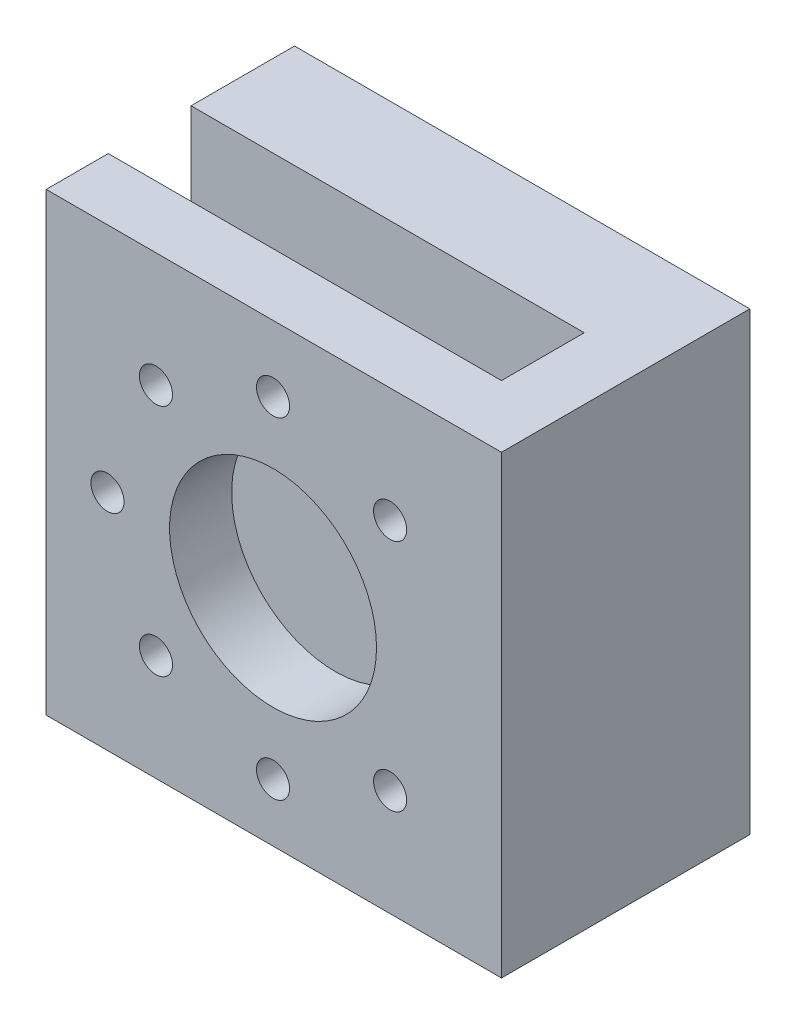
ISO-10303-21;
HEADER;
FILE_DESCRIPTION(('STEP AP214'),'2;1');
FILE_NAME('part.step','',(''),(''),'','','');
FILE_SCHEMA(('AUTOMOTIVE_DESIGN { 1 0 10303 214 1 1 1 1 }'));
ENDSEC;
DATA;
#1=APPLICATION_CONTEXT('core data for automotive mechanical design processes');
#2=APPLICATION_PROTOCOL_DEFINITION('international standard','automotive_design',2000,#1);
#3=PRODUCT_CONTEXT('',#1,'mechanical');
#4=PRODUCT('Part','Part','',(#3));
#5=PRODUCT_RELATED_PRODUCT_CATEGORY('part','',(#4));
#6=PRODUCT_DEFINITION_FORMATION('','',#4);
#7=PRODUCT_DEFINITION_CONTEXT('part definition',#1,'design');
#8=PRODUCT_DEFINITION('design','',#6,#7);
#9=PRODUCT_DEFINITION_SHAPE('','',#8);
#10=(LENGTH_UNIT() NAMED_UNIT(*) SI_UNIT(.MILLI.,.METRE.));
#11=(NAMED_UNIT(*) PLANE_ANGLE_UNIT() SI_UNIT($,.RADIAN.));
#12=(NAMED_UNIT(*) SI_UNIT($,.STERADIAN.) SOLID_ANGLE_UNIT());
#13=UNCERTAINTY_MEASURE_WITH_UNIT(LENGTH_MEASURE(1.E-05),#10,'distance_accuracy_value','');
#14=(GEOMETRIC_REPRESENTATION_CONTEXT(3) GLOBAL_UNCERTAINTY_ASSIGNED_CONTEXT((#13)) GLOBAL_UNIT_ASSIGNED_CONTEXT((#10,
#11,#12)) REPRESENTATION_CONTEXT('',''));
#15=CARTESIAN_POINT('',(0.,0.,0.));
#16=DIRECTION('',(0.,0.,1.));
#17=DIRECTION('',(1.,0.,0.));
#18=AXIS2_PLACEMENT_3D('',#15,#16,#17);
#19=CARTESIAN_POINT('',(30.189928032533,-41.0242307047734,12.5));
#20=DIRECTION('',(-1.,0.,0.));
#21=DIRECTION('',(0.,-1.,0.));
#22=AXIS2_PLACEMENT_3D('',#19,#20,#21);
#23=CYLINDRICAL_SURFACE('',#22,4.);
#24=CARTESIAN_POINT('',(-1.31007196746698,-41.0242307047734,12.5));
#25=DIRECTION('',(1.,0.,0.));
#26=DIRECTION('',(0.,1.,0.));
#27=AXIS2_PLACEMENT_3D('',#24,#25,#26);
#28=CIRCLE('',#27,4.);
#29=CARTESIAN_POINT('',(-1.31007196746697,-37.0242307047734,12.5));
#30=VERTEX_POINT('',#29);
#31=EDGE_CURVE('E215',#30,#30,#28,.T.);
#32=ORIENTED_EDGE('',*,*,#31,.T.);
#33=EDGE_LOOP('',(#32));
#34=FACE_BOUND('',#33,.T.);
#35=CARTESIAN_POINT('',(-34.810071967467,-41.0242307047734,12.5));
#36=DIRECTION('',(-1.,0.,0.));
#37=DIRECTION('',(0.,-1.,0.));
#38=AXIS2_PLACEMENT_3D('',#35,#36,#37);
#39=CIRCLE('',#38,4.);
#40=CARTESIAN_POINT('',(-34.810071967467,-45.0242307047734,12.5));
#41=VERTEX_POINT('',#40);
#42=EDGE_CURVE('E44',#41,#41,#39,.F.);
#43=ORIENTED_EDGE('',*,*,#42,.F.);
#44=EDGE_LOOP('',(#43));
#45=FACE_BOUND('',#44,.T.);
#46=ADVANCED_FACE('F40',(#34,#45),#23,.F.);
#47=CARTESIAN_POINT('',(0.189928032533093,0.921720798084353,25.));
#48=DIRECTION('',(0.,0.,-1.));
#49=DIRECTION('',(-1.,0.,0.));
#50=AXIS2_PLACEMENT_3D('',#47,#48,#49);
#51=CYLINDRICAL_SURFACE('',#50,19.);
#52=CARTESIAN_POINT('',(0.189928032533093,0.921720798084353,0.));
#53=DIRECTION('',(0.,0.,1.));
#54=DIRECTION('',(1.,0.,0.));
#55=AXIS2_PLACEMENT_3D('',#52,#53,#54);
#56=CIRCLE('',#55,19.);
#57=CARTESIAN_POINT('',(1.6899280325331,-18.0189761267915,0.));
#58=VERTEX_POINT('',#57);
#59=CARTESIAN_POINT('',(6.82022844235498,18.7273130790369,0.));
#60=VERTEX_POINT('',#59);
#61=EDGE_CURVE('E166',#58,#60,#56,.T.);
#62=ORIENTED_EDGE('',*,*,#61,.F.);
#63=DIRECTION('',(0.,0.,-1.));
#64=VECTOR('',#63,1.);
#65=CARTESIAN_POINT('',(1.6899280325331,-18.0189761267915,25.));
#66=LINE('',#65,#64);
#67=CARTESIAN_POINT('',(1.6899280325331,-18.0189761267915,25.));
#68=VERTEX_POINT('',#67);
#69=EDGE_CURVE('E11',#68,#58,#66,.T.);
#70=ORIENTED_EDGE('',*,*,#69,.F.);
#71=CARTESIAN_POINT('',(0.189928032533093,0.921720798084353,25.));
#72=DIRECTION('',(0.,0.,1.));
#73=DIRECTION('',(1.,0.,0.));
#74=AXIS2_PLACEMENT_3D('',#71,#72,#73);
#75=CIRCLE('',#74,19.);
#76=CARTESIAN_POINT('',(6.82022844235498,18.7273130790369,25.));
#77=VERTEX_POINT('',#76);
#78=EDGE_CURVE('E197',#68,#77,#75,.T.);
#79=ORIENTED_EDGE('',*,*,#78,.T.);
#80=DIRECTION('',(0.,0.,-1.));
#81=VECTOR('',#80,1.);
#82=CARTESIAN_POINT('',(6.82022844235498,18.7273130790369,25.));
#83=LINE('',#82,#81);
#84=EDGE_CURVE('E66',#77,#60,#83,.T.);
#85=ORIENTED_EDGE('',*,*,#84,.T.);
#86=EDGE_LOOP('',(#62,#70,#79,#85));
#87=FACE_BOUND('',#86,.T.);
#88=ADVANCED_FACE('F42',(#87),#51,.F.);
#89=CARTESIAN_POINT('',(1.68992803253316,0.,25.));
#90=DIRECTION('',(1.,0.,0.));
#91=DIRECTION('',(0.,1.,0.));
#92=AXIS2_PLACEMENT_3D('',#89,#90,#91);
#93=PLANE('',#92);
#94=CARTESIAN_POINT('',(1.68992803253302,-41.0242307047734,12.5));
#95=DIRECTION('',(1.,0.,0.));
#96=DIRECTION('',(0.,1.,0.));
#97=AXIS2_PLACEMENT_3D('',#94,#95,#96);
#98=CIRCLE('',#97,4.);
#99=CARTESIAN_POINT('',(1.68992803253303,-37.0242307047734,12.5));
#100=VERTEX_POINT('',#99);
#101=EDGE_CURVE('E169',#100,#100,#98,.T.);
#102=ORIENTED_EDGE('',*,*,#101,.T.);
#103=EDGE_LOOP('',(#102));
#104=FACE_BOUND('',#103,.T.);
#105=DIRECTION('',(0.,-1.,0.));
#106=VECTOR('',#105,1.);
#107=CARTESIAN_POINT('',(1.68992803253316,0.,0.));
#108=LINE('',#107,#106);
#109=CARTESIAN_POINT('',(1.68992803253297,-54.0242307047734,0.));
#110=VERTEX_POINT('',#109);
#111=EDGE_CURVE('E168',#58,#110,#108,.T.);
#112=ORIENTED_EDGE('',*,*,#111,.T.);
#113=DIRECTION('',(0.,0.,-1.));
#114=VECTOR('',#113,1.);
#115=CARTESIAN_POINT('',(1.68992803253297,-54.0242307047734,25.));
#116=LINE('',#115,#114);
#117=CARTESIAN_POINT('',(1.68992803253297,-54.0242307047734,25.));
#118=VERTEX_POINT('',#117);
#119=EDGE_CURVE('E49',#118,#110,#116,.T.);
#120=ORIENTED_EDGE('',*,*,#119,.F.);
#121=DIRECTION('',(0.,-1.,0.));
#122=VECTOR('',#121,1.);
#123=CARTESIAN_POINT('',(1.68992803253316,0.,25.));
#124=LINE('',#123,#122);
#125=EDGE_CURVE('E233',#68,#118,#124,.T.);
#126=ORIENTED_EDGE('',*,*,#125,.F.);
#127=ORIENTED_EDGE('',*,*,#69,.T.);
#128=EDGE_LOOP('',(#112,#120,#126,#127));
#129=FACE_BOUND('',#128,.T.);
#130=ADVANCED_FACE('F256',(#104,#129),#93,.F.);
#131=CARTESIAN_POINT('',(0.,-54.0242307047734,25.));
#132=DIRECTION('',(0.,1.,0.));
#133=DIRECTION('',(0.,0.,1.));
#134=AXIS2_PLACEMENT_3D('',#131,#132,#133);
#135=PLANE('',#134);
#136=DIRECTION('',(1.,0.,0.));
#137=VECTOR('',#136,1.);
#138=CARTESIAN_POINT('',(0.,-54.0242307047734,0.));
#139=LINE('',#138,#137);
#140=CARTESIAN_POINT('',(55.189928032533,-54.0242307047734,0.));
#141=VERTEX_POINT('',#140);
#142=EDGE_CURVE('E171',#110,#141,#139,.T.);
#143=ORIENTED_EDGE('',*,*,#142,.T.);
#144=DIRECTION('',(0.,0.,-1.));
#145=VECTOR('',#144,1.);
#146=CARTESIAN_POINT('',(55.189928032533,-54.0242307047734,25.));
#147=LINE('',#146,#145);
#148=CARTESIAN_POINT('',(55.189928032533,-54.0242307047734,60.));
#149=VERTEX_POINT('',#148);
#150=EDGE_CURVE('E212',#149,#141,#147,.T.);
#151=ORIENTED_EDGE('',*,*,#150,.F.);
#152=DIRECTION('',(1.,0.,0.));
#153=VECTOR('',#152,1.);
#154=CARTESIAN_POINT('',(55.189928032533,-54.0242307047734,60.));
#155=LINE('',#154,#153);
#156=CARTESIAN_POINT('',(-54.810071967467,-54.0242307047734,60.));
#157=VERTEX_POINT('',#156);
#158=EDGE_CURVE('E303',#157,#149,#155,.T.);
#159=ORIENTED_EDGE('',*,*,#158,.F.);
#160=DIRECTION('',(0.,0.,-1.));
#161=VECTOR('',#160,1.);
#162=CARTESIAN_POINT('',(-54.810071967467,-54.0242307047734,60.));
#163=LINE('',#162,#161);
#164=CARTESIAN_POINT('',(-54.810071967467,-54.0242307047734,45.));
#165=VERTEX_POINT('',#164);
#166=EDGE_CURVE('E313',#157,#165,#163,.T.);
#167=ORIENTED_EDGE('',*,*,#166,.T.);
#168=DIRECTION('',(1.,0.,0.));
#169=VECTOR('',#168,1.);
#170=CARTESIAN_POINT('',(55.189928032533,-54.0242307047734,45.));
#171=LINE('',#170,#169);
#172=CARTESIAN_POINT('',(40.189928032533,-54.0242307047734,45.));
#173=VERTEX_POINT('',#172);
#174=EDGE_CURVE('E328',#165,#173,#171,.T.);
#175=ORIENTED_EDGE('',*,*,#174,.T.);
#176=DIRECTION('',(0.,0.,-1.));
#177=VECTOR('',#176,1.);
#178=CARTESIAN_POINT('',(40.189928032533,-54.0242307047734,45.));
#179=LINE('',#178,#177);
#180=CARTESIAN_POINT('',(40.189928032533,-54.0242307047734,25.));
#181=VERTEX_POINT('',#180);
#182=EDGE_CURVE('E336',#173,#181,#179,.T.);
#183=ORIENTED_EDGE('',*,*,#182,.T.);
#184=DIRECTION('',(1.,0.,0.));
#185=VECTOR('',#184,1.);
#186=CARTESIAN_POINT('',(0.,-54.0242307047734,25.));
#187=LINE('',#186,#185);
#188=EDGE_CURVE('E235',#118,#181,#187,.T.);
#189=ORIENTED_EDGE('',*,*,#188,.F.);
#190=ORIENTED_EDGE('',*,*,#119,.T.);
#191=EDGE_LOOP('',(#143,#151,#159,#167,#175,#183,#189,#190));
#192=FACE_BOUND('',#191,.T.);
#193=ADVANCED_FACE('F261',(#192),#135,.F.);
#194=CARTESIAN_POINT('',(55.189928032533,0.,25.));
#195=DIRECTION('',(1.,0.,0.));
#196=DIRECTION('',(0.,1.,0.));
#197=AXIS2_PLACEMENT_3D('',#194,#195,#196);
#198=PLANE('',#197);
#199=DIRECTION('',(0.,-1.,0.));
#200=VECTOR('',#199,1.);
#201=CARTESIAN_POINT('',(55.189928032533,0.,0.));
#202=LINE('',#201,#200);
#203=CARTESIAN_POINT('',(55.189928032533,55.9757692952266,0.));
#204=VERTEX_POINT('',#203);
#205=EDGE_CURVE('E174',#204,#141,#202,.T.);
#206=ORIENTED_EDGE('',*,*,#205,.F.);
#207=DIRECTION('',(0.,0.,-1.));
#208=VECTOR('',#207,1.);
#209=CARTESIAN_POINT('',(55.189928032533,55.9757692952266,25.));
#210=LINE('',#209,#208);
#211=CARTESIAN_POINT('',(55.189928032533,55.9757692952266,60.));
#212=VERTEX_POINT('',#211);
#213=EDGE_CURVE('E210',#212,#204,#210,.T.);
#214=ORIENTED_EDGE('',*,*,#213,.F.);
#215=DIRECTION('',(0.,1.,0.));
#216=VECTOR('',#215,1.);
#217=CARTESIAN_POINT('',(55.189928032533,55.9757692952266,60.));
#218=LINE('',#217,#216);
#219=EDGE_CURVE('E298',#149,#212,#218,.T.);
#220=ORIENTED_EDGE('',*,*,#219,.F.);
#221=ORIENTED_EDGE('',*,*,#150,.T.);
#222=EDGE_LOOP('',(#206,#214,#220,#221));
#223=FACE_BOUND('',#222,.T.);
#224=ADVANCED_FACE('F292',(#223),#198,.T.);
#225=CARTESIAN_POINT('',(0.,55.9757692952266,25.));
#226=DIRECTION('',(0.,1.,0.));
#227=DIRECTION('',(0.,0.,1.));
#228=AXIS2_PLACEMENT_3D('',#225,#226,#227);
#229=PLANE('',#228);
#230=DIRECTION('',(1.,0.,0.));
#231=VECTOR('',#230,1.);
#232=CARTESIAN_POINT('',(0.,55.9757692952266,0.));
#233=LINE('',#232,#231);
#234=CARTESIAN_POINT('',(-54.810071967467,55.9757692952266,0.));
#235=VERTEX_POINT('',#234);
#236=EDGE_CURVE('E177',#235,#204,#233,.T.);
#237=ORIENTED_EDGE('',*,*,#236,.F.);
#238=DIRECTION('',(0.,0.,-1.));
#239=VECTOR('',#238,1.);
#240=CARTESIAN_POINT('',(-54.810071967467,55.9757692952266,25.));
#241=LINE('',#240,#239);
#242=CARTESIAN_POINT('',(-54.810071967467,55.9757692952266,25.));
#243=VERTEX_POINT('',#242);
#244=EDGE_CURVE('E208',#243,#235,#241,.T.);
#245=ORIENTED_EDGE('',*,*,#244,.F.);
#246=DIRECTION('',(1.,0.,0.));
#247=VECTOR('',#246,1.);
#248=CARTESIAN_POINT('',(0.,55.9757692952266,25.));
#249=LINE('',#248,#247);
#250=CARTESIAN_POINT('',(40.189928032533,55.9757692952266,25.));
#251=VERTEX_POINT('',#250);
#252=EDGE_CURVE('E237',#243,#251,#249,.T.);
#253=ORIENTED_EDGE('',*,*,#252,.T.);
#254=DIRECTION('',(0.,0.,-1.));
#255=VECTOR('',#254,1.);
#256=CARTESIAN_POINT('',(40.189928032533,55.9757692952266,45.));
#257=LINE('',#256,#255);
#258=CARTESIAN_POINT('',(40.189928032533,55.9757692952266,45.));
#259=VERTEX_POINT('',#258);
#260=EDGE_CURVE('E339',#259,#251,#257,.T.);
#261=ORIENTED_EDGE('',*,*,#260,.F.);
#262=DIRECTION('',(-1.,0.,0.));
#263=VECTOR('',#262,1.);
#264=CARTESIAN_POINT('',(55.189928032533,55.9757692952266,45.));
#265=LINE('',#264,#263);
#266=CARTESIAN_POINT('',(-54.810071967467,55.9757692952266,45.));
#267=VERTEX_POINT('',#266);
#268=EDGE_CURVE('E321',#259,#267,#265,.T.);
#269=ORIENTED_EDGE('',*,*,#268,.T.);
#270=DIRECTION('',(0.,0.,-1.));
#271=VECTOR('',#270,1.);
#272=CARTESIAN_POINT('',(-54.810071967467,55.9757692952266,60.));
#273=LINE('',#272,#271);
#274=CARTESIAN_POINT('',(-54.810071967467,55.9757692952266,60.));
#275=VERTEX_POINT('',#274);
#276=EDGE_CURVE('E315',#275,#267,#273,.T.);
#277=ORIENTED_EDGE('',*,*,#276,.F.);
#278=DIRECTION('',(-1.,0.,0.));
#279=VECTOR('',#278,1.);
#280=CARTESIAN_POINT('',(55.189928032533,55.9757692952266,60.));
#281=LINE('',#280,#279);
#282=EDGE_CURVE('E317',#212,#275,#281,.T.);
#283=ORIENTED_EDGE('',*,*,#282,.F.);
#284=ORIENTED_EDGE('',*,*,#213,.T.);
#285=EDGE_LOOP('',(#237,#245,#253,#261,#269,#277,#283,#284));
#286=FACE_BOUND('',#285,.T.);
#287=ADVANCED_FACE('F353',(#286),#229,.T.);
#288=CARTESIAN_POINT('',(-54.810071967467,0.,25.));
#289=DIRECTION('',(1.,0.,0.));
#290=DIRECTION('',(0.,1.,0.));
#291=AXIS2_PLACEMENT_3D('',#288,#289,#290);
#292=PLANE('',#291);
#293=CARTESIAN_POINT('',(-54.810071967467,-41.0242307047734,12.5));
#294=DIRECTION('',(-1.,0.,0.));
#295=DIRECTION('',(0.,-1.,0.));
#296=AXIS2_PLACEMENT_3D('',#293,#294,#295);
#297=CIRCLE('',#296,7.);
#298=CARTESIAN_POINT('',(-54.810071967467,-48.0242307047734,12.5));
#299=VERTEX_POINT('',#298);
#300=EDGE_CURVE('E229',#299,#299,#297,.T.);
#301=ORIENTED_EDGE('',*,*,#300,.F.);
#302=EDGE_LOOP('',(#301));
#303=FACE_BOUND('',#302,.T.);
#304=DIRECTION('',(0.,-1.,0.));
#305=VECTOR('',#304,1.);
#306=CARTESIAN_POINT('',(-54.810071967467,0.,0.));
#307=LINE('',#306,#305);
#308=CARTESIAN_POINT('',(-54.810071967467,-54.0242307047734,0.));
#309=VERTEX_POINT('',#308);
#310=EDGE_CURVE('E180',#235,#309,#307,.T.);
#311=ORIENTED_EDGE('',*,*,#310,.T.);
#312=DIRECTION('',(0.,0.,-1.));
#313=VECTOR('',#312,1.);
#314=CARTESIAN_POINT('',(-54.810071967467,-54.0242307047734,25.));
#315=LINE('',#314,#313);
#316=CARTESIAN_POINT('',(-54.810071967467,-54.0242307047734,25.));
#317=VERTEX_POINT('',#316);
#318=EDGE_CURVE('E205',#317,#309,#315,.T.);
#319=ORIENTED_EDGE('',*,*,#318,.F.);
#320=DIRECTION('',(0.,-1.,0.));
#321=VECTOR('',#320,1.);
#322=CARTESIAN_POINT('',(-54.810071967467,0.,25.));
#323=LINE('',#322,#321);
#324=EDGE_CURVE('E239',#243,#317,#323,.T.);
#325=ORIENTED_EDGE('',*,*,#324,.F.);
#326=ORIENTED_EDGE('',*,*,#244,.T.);
#327=EDGE_LOOP('',(#311,#319,#325,#326));
#328=FACE_BOUND('',#327,.T.);
#329=ADVANCED_FACE('F349',(#303,#328),#292,.F.);
#330=CARTESIAN_POINT('',(0.,-54.0242307047734,25.));
#331=DIRECTION('',(0.,1.,0.));
#332=DIRECTION('',(0.,0.,1.));
#333=AXIS2_PLACEMENT_3D('',#330,#331,#332);
#334=PLANE('',#333);
#335=DIRECTION('',(1.,0.,0.));
#336=VECTOR('',#335,1.);
#337=CARTESIAN_POINT('',(0.,-54.0242307047734,0.));
#338=LINE('',#337,#336);
#339=CARTESIAN_POINT('',(-1.31007196746703,-54.0242307047734,0.));
#340=VERTEX_POINT('',#339);
#341=EDGE_CURVE('E182',#309,#340,#338,.T.);
#342=ORIENTED_EDGE('',*,*,#341,.T.);
#343=DIRECTION('',(0.,0.,-1.));
#344=VECTOR('',#343,1.);
#345=CARTESIAN_POINT('',(-1.31007196746703,-54.0242307047734,25.));
#346=LINE('',#345,#344);
#347=CARTESIAN_POINT('',(-1.31007196746703,-54.0242307047734,25.));
#348=VERTEX_POINT('',#347);
#349=EDGE_CURVE('E203',#348,#340,#346,.T.);
#350=ORIENTED_EDGE('',*,*,#349,.F.);
#351=DIRECTION('',(1.,0.,0.));
#352=VECTOR('',#351,1.);
#353=CARTESIAN_POINT('',(0.,-54.0242307047734,25.));
#354=LINE('',#353,#352);
#355=EDGE_CURVE('E241',#317,#348,#354,.T.);
#356=ORIENTED_EDGE('',*,*,#355,.F.);
#357=ORIENTED_EDGE('',*,*,#318,.T.);
#358=EDGE_LOOP('',(#342,#350,#356,#357));
#359=FACE_BOUND('',#358,.T.);
#360=ADVANCED_FACE('F352',(#359),#334,.F.);
#361=CARTESIAN_POINT('',(-1.31007196746684,0.,25.));
#362=DIRECTION('',(1.,0.,0.));
#363=DIRECTION('',(0.,1.,0.));
#364=AXIS2_PLACEMENT_3D('',#361,#362,#363);
#365=PLANE('',#364);
#366=ORIENTED_EDGE('',*,*,#31,.F.);
#367=EDGE_LOOP('',(#366));
#368=FACE_BOUND('',#367,.T.);
#369=DIRECTION('',(0.,-1.,0.));
#370=VECTOR('',#369,1.);
#371=CARTESIAN_POINT('',(-1.31007196746684,0.,0.));
#372=LINE('',#371,#370);
#373=CARTESIAN_POINT('',(-1.3100719674669,-18.0189761267915,0.));
#374=VERTEX_POINT('',#373);
#375=EDGE_CURVE('E185',#374,#340,#372,.T.);
#376=ORIENTED_EDGE('',*,*,#375,.F.);
#377=DIRECTION('',(0.,0.,-1.));
#378=VECTOR('',#377,1.);
#379=CARTESIAN_POINT('',(-1.3100719674669,-18.0189761267915,25.));
#380=LINE('',#379,#378);
#381=CARTESIAN_POINT('',(-1.3100719674669,-18.0189761267915,25.));
#382=VERTEX_POINT('',#381);
#383=EDGE_CURVE('E201',#382,#374,#380,.T.);
#384=ORIENTED_EDGE('',*,*,#383,.F.);
#385=DIRECTION('',(0.,-1.,0.));
#386=VECTOR('',#385,1.);
#387=CARTESIAN_POINT('',(-1.31007196746684,0.,25.));
#388=LINE('',#387,#386);
#389=EDGE_CURVE('E243',#382,#348,#388,.T.);
#390=ORIENTED_EDGE('',*,*,#389,.T.);
#391=ORIENTED_EDGE('',*,*,#349,.T.);
#392=EDGE_LOOP('',(#376,#384,#390,#391));
#393=FACE_BOUND('',#392,.T.);
#394=ADVANCED_FACE('F362',(#368,#393),#365,.T.);
#395=CARTESIAN_POINT('',(0.189928032533093,0.921720798084353,25.));
#396=DIRECTION('',(0.,0.,-1.));
#397=DIRECTION('',(-1.,0.,0.));
#398=AXIS2_PLACEMENT_3D('',#395,#396,#397);
#399=CYLINDRICAL_SURFACE('',#398,19.);
#400=CARTESIAN_POINT('',(0.189928032533093,0.921720798084353,0.));
#401=DIRECTION('',(0.,0.,1.));
#402=DIRECTION('',(1.,0.,0.));
#403=AXIS2_PLACEMENT_3D('',#400,#401,#402);
#404=CIRCLE('',#403,19.);
#405=CARTESIAN_POINT('',(-6.44037237728879,18.7273130790369,0.));
#406=VERTEX_POINT('',#405);
#407=EDGE_CURVE('E188',#406,#374,#404,.T.);
#408=ORIENTED_EDGE('',*,*,#407,.F.);
#409=DIRECTION('',(0.,0.,-1.));
#410=VECTOR('',#409,1.);
#411=CARTESIAN_POINT('',(-6.44037237728879,18.7273130790369,25.));
#412=LINE('',#411,#410);
#413=CARTESIAN_POINT('',(-6.44037237728879,18.7273130790369,25.));
#414=VERTEX_POINT('',#413);
#415=EDGE_CURVE('E157',#414,#406,#412,.T.);
#416=ORIENTED_EDGE('',*,*,#415,.F.);
#417=CARTESIAN_POINT('',(0.189928032533093,0.921720798084353,25.));
#418=DIRECTION('',(0.,0.,1.));
#419=DIRECTION('',(1.,0.,0.));
#420=AXIS2_PLACEMENT_3D('',#417,#418,#419);
#421=CIRCLE('',#420,19.);
#422=EDGE_CURVE('E146',#414,#382,#421,.T.);
#423=ORIENTED_EDGE('',*,*,#422,.T.);
#424=ORIENTED_EDGE('',*,*,#383,.T.);
#425=EDGE_LOOP('',(#408,#416,#423,#424));
#426=FACE_BOUND('',#425,.T.);
#427=ADVANCED_FACE('F247',(#426),#399,.F.);
#428=CARTESIAN_POINT('',(-6.44037237728833,-1.58745285573057E-13,25.));
#429=DIRECTION('',(-1.,0.,0.));
#430=DIRECTION('',(0.,-1.,0.));
#431=AXIS2_PLACEMENT_3D('',#428,#429,#430);
#432=PLANE('',#431);
#433=DIRECTION('',(0.,1.,0.));
#434=VECTOR('',#433,1.);
#435=CARTESIAN_POINT('',(-6.44037237728833,-1.58745285573057E-13,0.));
#436=LINE('',#435,#434);
#437=CARTESIAN_POINT('',(-6.44037237728888,22.3869983796891,0.));
#438=VERTEX_POINT('',#437);
#439=EDGE_CURVE('E153',#406,#438,#436,.T.);
#440=ORIENTED_EDGE('',*,*,#439,.T.);
#441=DIRECTION('',(0.,0.,-1.));
#442=VECTOR('',#441,1.);
#443=CARTESIAN_POINT('',(-6.44037237728888,22.3869983796891,25.));
#444=LINE('',#443,#442);
#445=CARTESIAN_POINT('',(-6.44037237728888,22.3869983796891,25.));
#446=VERTEX_POINT('',#445);
#447=EDGE_CURVE('E150',#446,#438,#444,.T.);
#448=ORIENTED_EDGE('',*,*,#447,.F.);
#449=DIRECTION('',(0.,1.,0.));
#450=VECTOR('',#449,1.);
#451=CARTESIAN_POINT('',(-6.44037237728833,-1.58745285573057E-13,25.));
#452=LINE('',#451,#450);
#453=EDGE_CURVE('E137',#414,#446,#452,.T.);
#454=ORIENTED_EDGE('',*,*,#453,.F.);
#455=ORIENTED_EDGE('',*,*,#415,.T.);
#456=EDGE_LOOP('',(#440,#448,#454,#455));
#457=FACE_BOUND('',#456,.T.);
#458=ADVANCED_FACE('F151',(#457),#432,.F.);
#459=CARTESIAN_POINT('',(0.,22.3869983796891,25.));
#460=DIRECTION('',(0.,1.,0.));
#461=DIRECTION('',(0.,0.,1.));
#462=AXIS2_PLACEMENT_3D('',#459,#460,#461);
#463=PLANE('',#462);
#464=DIRECTION('',(1.,0.,0.));
#465=VECTOR('',#464,1.);
#466=CARTESIAN_POINT('',(0.,22.3869983796891,0.));
#467=LINE('',#466,#465);
#468=CARTESIAN_POINT('',(6.82022844235488,22.3869983796891,0.));
#469=VERTEX_POINT('',#468);
#470=EDGE_CURVE('E192',#438,#469,#467,.T.);
#471=ORIENTED_EDGE('',*,*,#470,.T.);
#472=DIRECTION('',(0.,0.,-1.));
#473=VECTOR('',#472,1.);
#474=CARTESIAN_POINT('',(6.82022844235488,22.3869983796891,25.));
#475=LINE('',#474,#473);
#476=CARTESIAN_POINT('',(6.82022844235488,22.3869983796891,25.));
#477=VERTEX_POINT('',#476);
#478=EDGE_CURVE('E158',#477,#469,#475,.T.);
#479=ORIENTED_EDGE('',*,*,#478,.F.);
#480=DIRECTION('',(1.,0.,0.));
#481=VECTOR('',#480,1.);
#482=CARTESIAN_POINT('',(0.,22.3869983796891,25.));
#483=LINE('',#482,#481);
#484=EDGE_CURVE('E142',#446,#477,#483,.T.);
#485=ORIENTED_EDGE('',*,*,#484,.F.);
#486=ORIENTED_EDGE('',*,*,#447,.T.);
#487=EDGE_LOOP('',(#471,#479,#485,#486));
#488=FACE_BOUND('',#487,.T.);
#489=ADVANCED_FACE('F160',(#488),#463,.F.);
#490=CARTESIAN_POINT('',(6.82022844235545,1.7295742772686E-13,25.));
#491=DIRECTION('',(-1.,0.,0.));
#492=DIRECTION('',(0.,-1.,0.));
#493=AXIS2_PLACEMENT_3D('',#490,#491,#492);
#494=PLANE('',#493);
#495=DIRECTION('',(0.,1.,0.));
#496=VECTOR('',#495,1.);
#497=CARTESIAN_POINT('',(6.82022844235545,1.7295742772686E-13,0.));
#498=LINE('',#497,#496);
#499=EDGE_CURVE('E194',#60,#469,#498,.T.);
#500=ORIENTED_EDGE('',*,*,#499,.F.);
#501=ORIENTED_EDGE('',*,*,#84,.F.);
#502=DIRECTION('',(0.,1.,0.));
#503=VECTOR('',#502,1.);
#504=CARTESIAN_POINT('',(6.82022844235545,1.7295742772686E-13,25.));
#505=LINE('',#504,#503);
#506=EDGE_CURVE('E161',#77,#477,#505,.T.);
#507=ORIENTED_EDGE('',*,*,#506,.T.);
#508=ORIENTED_EDGE('',*,*,#478,.T.);
#509=EDGE_LOOP('',(#500,#501,#507,#508));
#510=FACE_BOUND('',#509,.T.);
#511=ADVANCED_FACE('F252',(#510),#494,.T.);
#512=CARTESIAN_POINT('',(0.,0.,25.));
#513=DIRECTION('',(0.,0.,1.));
#514=DIRECTION('',(1.,0.,0.));
#515=AXIS2_PLACEMENT_3D('',#512,#513,#514);
#516=PLANE('',#515);
#517=DIRECTION('',(0.,-1.,0.));
#518=VECTOR('',#517,1.);
#519=CARTESIAN_POINT('',(40.189928032533,55.9757692952266,25.));
#520=LINE('',#519,#518);
#521=EDGE_CURVE('E57',#251,#181,#520,.T.);
#522=ORIENTED_EDGE('',*,*,#521,.F.);
#523=ORIENTED_EDGE('',*,*,#252,.F.);
#524=ORIENTED_EDGE('',*,*,#324,.T.);
#525=ORIENTED_EDGE('',*,*,#355,.T.);
#526=ORIENTED_EDGE('',*,*,#389,.F.);
#527=ORIENTED_EDGE('',*,*,#422,.F.);
#528=ORIENTED_EDGE('',*,*,#453,.T.);
#529=ORIENTED_EDGE('',*,*,#484,.T.);
#530=ORIENTED_EDGE('',*,*,#506,.F.);
#531=ORIENTED_EDGE('',*,*,#78,.F.);
#532=ORIENTED_EDGE('',*,*,#125,.T.);
#533=ORIENTED_EDGE('',*,*,#188,.T.);
#534=EDGE_LOOP('',(#522,#523,#524,#525,#526,#527,#528,#529,#530,#531,#532,#533));
#535=FACE_BOUND('',#534,.T.);
#536=ADVANCED_FACE('F139',(#535),#516,.T.);
#537=CARTESIAN_POINT('',(0.,0.,0.));
#538=DIRECTION('',(0.,0.,1.));
#539=DIRECTION('',(1.,0.,0.));
#540=AXIS2_PLACEMENT_3D('',#537,#538,#539);
#541=PLANE('',#540);
#542=ORIENTED_EDGE('',*,*,#61,.T.);
#543=ORIENTED_EDGE('',*,*,#499,.T.);
#544=ORIENTED_EDGE('',*,*,#470,.F.);
#545=ORIENTED_EDGE('',*,*,#439,.F.);
#546=ORIENTED_EDGE('',*,*,#407,.T.);
#547=ORIENTED_EDGE('',*,*,#375,.T.);
#548=ORIENTED_EDGE('',*,*,#341,.F.);
#549=ORIENTED_EDGE('',*,*,#310,.F.);
#550=ORIENTED_EDGE('',*,*,#236,.T.);
#551=ORIENTED_EDGE('',*,*,#205,.T.);
#552=ORIENTED_EDGE('',*,*,#142,.F.);
#553=ORIENTED_EDGE('',*,*,#111,.F.);
#554=EDGE_LOOP('',(#542,#543,#544,#545,#546,#547,#548,#549,#550,#551,#552,#553));
#555=FACE_BOUND('',#554,.T.);
#556=ADVANCED_FACE('F250',(#555),#541,.F.);
#557=CARTESIAN_POINT('',(30.189928032533,-41.0242307047734,12.5));
#558=DIRECTION('',(-1.,0.,0.));
#559=DIRECTION('',(0.,-1.,0.));
#560=AXIS2_PLACEMENT_3D('',#557,#558,#559);
#561=CIRCLE('',#560,4.);
#562=CARTESIAN_POINT('',(30.189928032533,-45.0242307047734,12.5));
#563=VERTEX_POINT('',#562);
#564=EDGE_CURVE('E217',#563,#563,#561,.T.);
#565=ORIENTED_EDGE('',*,*,#564,.F.);
#566=EDGE_LOOP('',(#565));
#567=FACE_BOUND('',#566,.T.);
#568=ORIENTED_EDGE('',*,*,#101,.F.);
#569=EDGE_LOOP('',(#568));
#570=FACE_BOUND('',#569,.T.);
#571=ADVANCED_FACE('F264',(#567,#570),#23,.F.);
#572=CARTESIAN_POINT('',(30.189928032533,-41.0242307047734,12.5));
#573=DIRECTION('',(-1.,0.,0.));
#574=DIRECTION('',(0.,-1.,0.));
#575=AXIS2_PLACEMENT_3D('',#572,#573,#574);
#576=PLANE('',#575);
#577=ORIENTED_EDGE('',*,*,#564,.T.);
#578=EDGE_LOOP('',(#577));
#579=FACE_BOUND('',#578,.T.);
#580=ADVANCED_FACE('F271',(#579),#576,.T.);
#581=CARTESIAN_POINT('',(-34.810071967467,-41.0242307047734,12.5));
#582=DIRECTION('',(-1.,0.,0.));
#583=DIRECTION('',(0.,-1.,0.));
#584=AXIS2_PLACEMENT_3D('',#581,#582,#583);
#585=PLANE('',#584);
#586=CARTESIAN_POINT('',(-34.810071967467,-41.0242307047734,12.5));
#587=DIRECTION('',(-1.,0.,0.));
#588=DIRECTION('',(0.,-1.,0.));
#589=AXIS2_PLACEMENT_3D('',#586,#587,#588);
#590=CIRCLE('',#589,7.);
#591=CARTESIAN_POINT('',(-34.810071967467,-48.0242307047734,12.5));
#592=VERTEX_POINT('',#591);
#593=EDGE_CURVE('E227',#592,#592,#590,.T.);
#594=ORIENTED_EDGE('',*,*,#593,.T.);
#595=EDGE_LOOP('',(#594));
#596=FACE_BOUND('',#595,.T.);
#597=ORIENTED_EDGE('',*,*,#42,.T.);
#598=EDGE_LOOP('',(#597));
#599=FACE_BOUND('',#598,.T.);
#600=ADVANCED_FACE('F277',(#596,#599),#585,.T.);
#601=CARTESIAN_POINT('',(-34.810071967467,-41.0242307047734,12.5));
#602=DIRECTION('',(-1.,0.,0.));
#603=DIRECTION('',(0.,-1.,0.));
#604=AXIS2_PLACEMENT_3D('',#601,#602,#603);
#605=CYLINDRICAL_SURFACE('',#604,7.);
#606=ORIENTED_EDGE('',*,*,#593,.F.);
#607=EDGE_LOOP('',(#606));
#608=FACE_BOUND('',#607,.T.);
#609=ORIENTED_EDGE('',*,*,#300,.T.);
#610=EDGE_LOOP('',(#609));
#611=FACE_BOUND('',#610,.T.);
#612=ADVANCED_FACE('F347',(#608,#611),#605,.F.);
#613=CARTESIAN_POINT('',(40.189928032533,55.9757692952266,45.));
#614=DIRECTION('',(1.,0.,0.));
#615=DIRECTION('',(0.,1.,0.));
#616=AXIS2_PLACEMENT_3D('',#613,#614,#615);
#617=PLANE('',#616);
#618=ORIENTED_EDGE('',*,*,#521,.T.);
#619=ORIENTED_EDGE('',*,*,#182,.F.);
#620=DIRECTION('',(0.,-1.,0.));
#621=VECTOR('',#620,1.);
#622=CARTESIAN_POINT('',(40.189928032533,55.9757692952266,45.));
#623=LINE('',#622,#621);
#624=EDGE_CURVE('E333',#259,#173,#623,.T.);
#625=ORIENTED_EDGE('',*,*,#624,.F.);
#626=ORIENTED_EDGE('',*,*,#260,.T.);
#627=EDGE_LOOP('',(#618,#619,#625,#626));
#628=FACE_BOUND('',#627,.T.);
#629=ADVANCED_FACE('F367',(#628),#617,.F.);
#630=CARTESIAN_POINT('',(-54.810071967467,55.9757692952266,60.));
#631=DIRECTION('',(1.,0.,0.));
#632=DIRECTION('',(0.,1.,0.));
#633=AXIS2_PLACEMENT_3D('',#630,#631,#632);
#634=PLANE('',#633);
#635=DIRECTION('',(0.,-1.,0.));
#636=VECTOR('',#635,1.);
#637=CARTESIAN_POINT('',(-54.810071967467,55.9757692952266,45.));
#638=LINE('',#637,#636);
#639=EDGE_CURVE('E324',#267,#165,#638,.T.);
#640=ORIENTED_EDGE('',*,*,#639,.T.);
#641=ORIENTED_EDGE('',*,*,#166,.F.);
#642=DIRECTION('',(0.,-1.,0.));
#643=VECTOR('',#642,1.);
#644=CARTESIAN_POINT('',(-54.810071967467,55.9757692952266,60.));
#645=LINE('',#644,#643);
#646=EDGE_CURVE('E311',#275,#157,#645,.T.);
#647=ORIENTED_EDGE('',*,*,#646,.F.);
#648=ORIENTED_EDGE('',*,*,#276,.T.);
#649=EDGE_LOOP('',(#640,#641,#647,#648));
#650=FACE_BOUND('',#649,.T.);
#651=ADVANCED_FACE('F380',(#650),#634,.F.);
#652=CARTESIAN_POINT('',(0.,0.,60.));
#653=DIRECTION('',(0.,0.,-1.));
#654=DIRECTION('',(-1.,0.,0.));
#655=AXIS2_PLACEMENT_3D('',#652,#653,#654);
#656=PLANE('',#655);
#657=CARTESIAN_POINT('',(-28.284271247462,28.2842712474618,60.));
#658=DIRECTION('',(0.,0.,1.));
#659=DIRECTION('',(1.,0.,0.));
#660=AXIS2_PLACEMENT_3D('',#657,#658,#659);
#661=CIRCLE('',#660,3.99999999999999);
#662=CARTESIAN_POINT('',(-24.2842712474621,28.2842712474618,60.));
#663=VERTEX_POINT('',#662);
#664=EDGE_CURVE('E406',#663,#663,#661,.T.);
#665=ORIENTED_EDGE('',*,*,#664,.F.);
#666=EDGE_LOOP('',(#665));
#667=FACE_BOUND('',#666,.T.);
#668=CARTESIAN_POINT('',(0.,-40.,60.));
#669=DIRECTION('',(0.,0.,1.));
#670=DIRECTION('',(1.,0.,0.));
#671=AXIS2_PLACEMENT_3D('',#668,#669,#670);
#672=CIRCLE('',#671,4.);
#673=CARTESIAN_POINT('',(4.,-40.,60.));
#674=VERTEX_POINT('',#673);
#675=EDGE_CURVE('E413',#674,#674,#672,.T.);
#676=ORIENTED_EDGE('',*,*,#675,.F.);
#677=EDGE_LOOP('',(#676));
#678=FACE_BOUND('',#677,.T.);
#679=CARTESIAN_POINT('',(-40.,0.,60.));
#680=DIRECTION('',(0.,0.,1.));
#681=DIRECTION('',(1.,0.,0.));
#682=AXIS2_PLACEMENT_3D('',#679,#680,#681);
#683=CIRCLE('',#682,4.);
#684=CARTESIAN_POINT('',(-36.,0.,60.));
#685=VERTEX_POINT('',#684);
#686=EDGE_CURVE('E394',#685,#685,#683,.T.);
#687=ORIENTED_EDGE('',*,*,#686,.F.);
#688=EDGE_LOOP('',(#687));
#689=FACE_BOUND('',#688,.T.);
#690=CARTESIAN_POINT('',(0.,40.,60.));
#691=DIRECTION('',(0.,0.,1.));
#692=DIRECTION('',(1.,0.,0.));
#693=AXIS2_PLACEMENT_3D('',#690,#691,#692);
#694=CIRCLE('',#693,4.);
#695=CARTESIAN_POINT('',(4.,40.,60.));
#696=VERTEX_POINT('',#695);
#697=EDGE_CURVE('E401',#696,#696,#694,.T.);
#698=ORIENTED_EDGE('',*,*,#697,.F.);
#699=EDGE_LOOP('',(#698));
#700=FACE_BOUND('',#699,.T.);
#701=CARTESIAN_POINT('',(28.2842712474621,28.2842712474618,60.));
#702=DIRECTION('',(0.,0.,1.));
#703=DIRECTION('',(1.,0.,0.));
#704=AXIS2_PLACEMENT_3D('',#701,#702,#703);
#705=CIRCLE('',#704,4.00000000000001);
#706=CARTESIAN_POINT('',(32.2842712474621,28.2842712474618,60.));
#707=VERTEX_POINT('',#706);
#708=EDGE_CURVE('E430',#707,#707,#705,.T.);
#709=ORIENTED_EDGE('',*,*,#708,.F.);
#710=EDGE_LOOP('',(#709));
#711=FACE_BOUND('',#710,.T.);
#712=CARTESIAN_POINT('',(28.2842712474621,-28.2842712474618,60.));
#713=DIRECTION('',(0.,0.,1.));
#714=DIRECTION('',(1.,0.,0.));
#715=AXIS2_PLACEMENT_3D('',#712,#713,#714);
#716=CIRCLE('',#715,4.00000000000001);
#717=CARTESIAN_POINT('',(32.2842712474621,-28.2842712474618,60.));
#718=VERTEX_POINT('',#717);
#719=EDGE_CURVE('E424',#718,#718,#716,.T.);
#720=ORIENTED_EDGE('',*,*,#719,.F.);
#721=EDGE_LOOP('',(#720));
#722=FACE_BOUND('',#721,.T.);
#723=CARTESIAN_POINT('',(-28.284271247462,-28.2842712474618,60.));
#724=DIRECTION('',(0.,0.,1.));
#725=DIRECTION('',(1.,0.,0.));
#726=AXIS2_PLACEMENT_3D('',#723,#724,#725);
#727=CIRCLE('',#726,3.99999999999995);
#728=CARTESIAN_POINT('',(-24.284271247462,-28.2842712474618,60.));
#729=VERTEX_POINT('',#728);
#730=EDGE_CURVE('E418',#729,#729,#727,.T.);
#731=ORIENTED_EDGE('',*,*,#730,.F.);
#732=EDGE_LOOP('',(#731));
#733=FACE_BOUND('',#732,.T.);
#734=CARTESIAN_POINT('',(0.,0.,60.));
#735=DIRECTION('',(0.,0.,1.));
#736=DIRECTION('',(1.,0.,0.));
#737=AXIS2_PLACEMENT_3D('',#734,#735,#736);
#738=CIRCLE('',#737,25.);
#739=CARTESIAN_POINT('',(25.,0.,60.));
#740=VERTEX_POINT('',#739);
#741=EDGE_CURVE('E388',#740,#740,#738,.T.);
#742=ORIENTED_EDGE('',*,*,#741,.F.);
#743=EDGE_LOOP('',(#742));
#744=FACE_BOUND('',#743,.T.);
#745=ORIENTED_EDGE('',*,*,#219,.T.);
#746=ORIENTED_EDGE('',*,*,#282,.T.);
#747=ORIENTED_EDGE('',*,*,#646,.T.);
#748=ORIENTED_EDGE('',*,*,#158,.T.);
#749=EDGE_LOOP('',(#745,#746,#747,#748));
#750=FACE_BOUND('',#749,.T.);
#751=ADVANCED_FACE('F308',(#667,#678,#689,#700,#711,#722,#733,#744,#750),#656,.F.);
#752=CARTESIAN_POINT('',(0.,0.,45.));
#753=DIRECTION('',(0.,0.,-1.));
#754=DIRECTION('',(-1.,0.,0.));
#755=AXIS2_PLACEMENT_3D('',#752,#753,#754);
#756=PLANE('',#755);
#757=CARTESIAN_POINT('',(-28.284271247462,28.2842712474618,45.));
#758=DIRECTION('',(0.,0.,1.));
#759=DIRECTION('',(1.,0.,0.));
#760=AXIS2_PLACEMENT_3D('',#757,#758,#759);
#761=CIRCLE('',#760,3.99999999999999);
#762=CARTESIAN_POINT('',(-24.2842712474621,28.2842712474618,45.));
#763=VERTEX_POINT('',#762);
#764=EDGE_CURVE('E409',#763,#763,#761,.T.);
#765=ORIENTED_EDGE('',*,*,#764,.T.);
#766=EDGE_LOOP('',(#765));
#767=FACE_BOUND('',#766,.T.);
#768=CARTESIAN_POINT('',(0.,-40.,45.));
#769=DIRECTION('',(0.,0.,1.));
#770=DIRECTION('',(1.,0.,0.));
#771=AXIS2_PLACEMENT_3D('',#768,#769,#770);
#772=CIRCLE('',#771,4.);
#773=CARTESIAN_POINT('',(4.,-40.,45.));
#774=VERTEX_POINT('',#773);
#775=EDGE_CURVE('E398',#774,#774,#772,.T.);
#776=ORIENTED_EDGE('',*,*,#775,.T.);
#777=EDGE_LOOP('',(#776));
#778=FACE_BOUND('',#777,.T.);
#779=CARTESIAN_POINT('',(-40.,0.,45.));
#780=DIRECTION('',(0.,0.,1.));
#781=DIRECTION('',(1.,0.,0.));
#782=AXIS2_PLACEMENT_3D('',#779,#780,#781);
#783=CIRCLE('',#782,4.);
#784=CARTESIAN_POINT('',(-36.,0.,45.));
#785=VERTEX_POINT('',#784);
#786=EDGE_CURVE('E397',#785,#785,#783,.T.);
#787=ORIENTED_EDGE('',*,*,#786,.T.);
#788=EDGE_LOOP('',(#787));
#789=FACE_BOUND('',#788,.T.);
#790=CARTESIAN_POINT('',(0.,40.,45.));
#791=DIRECTION('',(0.,0.,1.));
#792=DIRECTION('',(1.,0.,0.));
#793=AXIS2_PLACEMENT_3D('',#790,#791,#792);
#794=CIRCLE('',#793,4.);
#795=CARTESIAN_POINT('',(4.,40.,45.));
#796=VERTEX_POINT('',#795);
#797=EDGE_CURVE('E391',#796,#796,#794,.T.);
#798=ORIENTED_EDGE('',*,*,#797,.T.);
#799=EDGE_LOOP('',(#798));
#800=FACE_BOUND('',#799,.T.);
#801=CARTESIAN_POINT('',(28.2842712474621,28.2842712474618,45.));
#802=DIRECTION('',(0.,0.,1.));
#803=DIRECTION('',(1.,0.,0.));
#804=AXIS2_PLACEMENT_3D('',#801,#802,#803);
#805=CIRCLE('',#804,4.00000000000001);
#806=CARTESIAN_POINT('',(32.2842712474621,28.2842712474618,45.));
#807=VERTEX_POINT('',#806);
#808=EDGE_CURVE('E410',#807,#807,#805,.T.);
#809=ORIENTED_EDGE('',*,*,#808,.T.);
#810=EDGE_LOOP('',(#809));
#811=FACE_BOUND('',#810,.T.);
#812=CARTESIAN_POINT('',(28.2842712474621,-28.2842712474618,45.));
#813=DIRECTION('',(0.,0.,1.));
#814=DIRECTION('',(1.,0.,0.));
#815=AXIS2_PLACEMENT_3D('',#812,#813,#814);
#816=CIRCLE('',#815,4.00000000000001);
#817=CARTESIAN_POINT('',(32.2842712474621,-28.2842712474618,45.));
#818=VERTEX_POINT('',#817);
#819=EDGE_CURVE('E427',#818,#818,#816,.T.);
#820=ORIENTED_EDGE('',*,*,#819,.T.);
#821=EDGE_LOOP('',(#820));
#822=FACE_BOUND('',#821,.T.);
#823=CARTESIAN_POINT('',(-28.284271247462,-28.2842712474618,45.));
#824=DIRECTION('',(0.,0.,1.));
#825=DIRECTION('',(1.,0.,0.));
#826=AXIS2_PLACEMENT_3D('',#823,#824,#825);
#827=CIRCLE('',#826,3.99999999999995);
#828=CARTESIAN_POINT('',(-24.284271247462,-28.2842712474618,45.));
#829=VERTEX_POINT('',#828);
#830=EDGE_CURVE('E421',#829,#829,#827,.T.);
#831=ORIENTED_EDGE('',*,*,#830,.T.);
#832=EDGE_LOOP('',(#831));
#833=FACE_BOUND('',#832,.T.);
#834=CARTESIAN_POINT('',(0.,0.,45.));
#835=DIRECTION('',(0.,0.,1.));
#836=DIRECTION('',(1.,0.,0.));
#837=AXIS2_PLACEMENT_3D('',#834,#835,#836);
#838=CIRCLE('',#837,25.);
#839=CARTESIAN_POINT('',(25.,0.,45.));
#840=VERTEX_POINT('',#839);
#841=EDGE_CURVE('E325',#840,#840,#838,.T.);
#842=ORIENTED_EDGE('',*,*,#841,.T.);
#843=EDGE_LOOP('',(#842));
#844=FACE_BOUND('',#843,.T.);
#845=ORIENTED_EDGE('',*,*,#268,.F.);
#846=ORIENTED_EDGE('',*,*,#624,.T.);
#847=ORIENTED_EDGE('',*,*,#174,.F.);
#848=ORIENTED_EDGE('',*,*,#639,.F.);
#849=EDGE_LOOP('',(#845,#846,#847,#848));
#850=FACE_BOUND('',#849,.T.);
#851=ADVANCED_FACE('F373',(#767,#778,#789,#800,#811,#822,#833,#844,#850),#756,.T.);
#852=CARTESIAN_POINT('',(0.,0.,45.));
#853=DIRECTION('',(0.,0.,1.));
#854=DIRECTION('',(1.,0.,0.));
#855=AXIS2_PLACEMENT_3D('',#852,#853,#854);
#856=CYLINDRICAL_SURFACE('',#855,25.);
#857=ORIENTED_EDGE('',*,*,#841,.F.);
#858=EDGE_LOOP('',(#857));
#859=FACE_BOUND('',#858,.T.);
#860=ORIENTED_EDGE('',*,*,#741,.T.);
#861=EDGE_LOOP('',(#860));
#862=FACE_BOUND('',#861,.T.);
#863=ADVANCED_FACE('F456',(#859,#862),#856,.F.);
#864=CARTESIAN_POINT('',(-28.284271247462,-28.2842712474618,45.));
#865=DIRECTION('',(0.,0.,1.));
#866=DIRECTION('',(1.,0.,0.));
#867=AXIS2_PLACEMENT_3D('',#864,#865,#866);
#868=CYLINDRICAL_SURFACE('',#867,3.99999999999995);
#869=ORIENTED_EDGE('',*,*,#830,.F.);
#870=EDGE_LOOP('',(#869));
#871=FACE_BOUND('',#870,.T.);
#872=ORIENTED_EDGE('',*,*,#730,.T.);
#873=EDGE_LOOP('',(#872));
#874=FACE_BOUND('',#873,.T.);
#875=ADVANCED_FACE('F458',(#871,#874),#868,.F.);
#876=CARTESIAN_POINT('',(28.2842712474621,-28.2842712474618,45.));
#877=DIRECTION('',(0.,0.,1.));
#878=DIRECTION('',(1.,0.,0.));
#879=AXIS2_PLACEMENT_3D('',#876,#877,#878);
#880=CYLINDRICAL_SURFACE('',#879,4.00000000000001);
#881=ORIENTED_EDGE('',*,*,#819,.F.);
#882=EDGE_LOOP('',(#881));
#883=FACE_BOUND('',#882,.T.);
#884=ORIENTED_EDGE('',*,*,#719,.T.);
#885=EDGE_LOOP('',(#884));
#886=FACE_BOUND('',#885,.T.);
#887=ADVANCED_FACE('F442',(#883,#886),#880,.F.);
#888=CARTESIAN_POINT('',(28.2842712474621,28.2842712474618,45.));
#889=DIRECTION('',(0.,0.,1.));
#890=DIRECTION('',(1.,0.,0.));
#891=AXIS2_PLACEMENT_3D('',#888,#889,#890);
#892=CYLINDRICAL_SURFACE('',#891,4.00000000000001);
#893=ORIENTED_EDGE('',*,*,#808,.F.);
#894=EDGE_LOOP('',(#893));
#895=FACE_BOUND('',#894,.T.);
#896=ORIENTED_EDGE('',*,*,#708,.T.);
#897=EDGE_LOOP('',(#896));
#898=FACE_BOUND('',#897,.T.);
#899=ADVANCED_FACE('F438',(#895,#898),#892,.F.);
#900=CARTESIAN_POINT('',(0.,40.,45.));
#901=DIRECTION('',(0.,0.,1.));
#902=DIRECTION('',(1.,0.,0.));
#903=AXIS2_PLACEMENT_3D('',#900,#901,#902);
#904=CYLINDRICAL_SURFACE('',#903,4.);
#905=ORIENTED_EDGE('',*,*,#797,.F.);
#906=EDGE_LOOP('',(#905));
#907=FACE_BOUND('',#906,.T.);
#908=ORIENTED_EDGE('',*,*,#697,.T.);
#909=EDGE_LOOP('',(#908));
#910=FACE_BOUND('',#909,.T.);
#911=ADVANCED_FACE('F441',(#907,#910),#904,.F.);
#912=CARTESIAN_POINT('',(-40.,0.,45.));
#913=DIRECTION('',(0.,0.,1.));
#914=DIRECTION('',(1.,0.,0.));
#915=AXIS2_PLACEMENT_3D('',#912,#913,#914);
#916=CYLINDRICAL_SURFACE('',#915,4.);
#917=ORIENTED_EDGE('',*,*,#786,.F.);
#918=EDGE_LOOP('',(#917));
#919=FACE_BOUND('',#918,.T.);
#920=ORIENTED_EDGE('',*,*,#686,.T.);
#921=EDGE_LOOP('',(#920));
#922=FACE_BOUND('',#921,.T.);
#923=ADVANCED_FACE('F471',(#919,#922),#916,.F.);
#924=CARTESIAN_POINT('',(0.,-40.,45.));
#925=DIRECTION('',(0.,0.,1.));
#926=DIRECTION('',(1.,0.,0.));
#927=AXIS2_PLACEMENT_3D('',#924,#925,#926);
#928=CYLINDRICAL_SURFACE('',#927,4.);
#929=ORIENTED_EDGE('',*,*,#775,.F.);
#930=EDGE_LOOP('',(#929));
#931=FACE_BOUND('',#930,.T.);
#932=ORIENTED_EDGE('',*,*,#675,.T.);
#933=EDGE_LOOP('',(#932));
#934=FACE_BOUND('',#933,.T.);
#935=ADVANCED_FACE('F568',(#931,#934),#928,.F.);
#936=CARTESIAN_POINT('',(-28.284271247462,28.2842712474618,45.));
#937=DIRECTION('',(0.,0.,1.));
#938=DIRECTION('',(1.,0.,0.));
#939=AXIS2_PLACEMENT_3D('',#936,#937,#938);
#940=CYLINDRICAL_SURFACE('',#939,3.99999999999999);
#941=ORIENTED_EDGE('',*,*,#764,.F.);
#942=EDGE_LOOP('',(#941));
#943=FACE_BOUND('',#942,.T.);
#944=ORIENTED_EDGE('',*,*,#664,.T.);
#945=EDGE_LOOP('',(#944));
#946=FACE_BOUND('',#945,.T.);
#947=ADVANCED_FACE('F579',(#943,#946),#940,.F.);
#948=CLOSED_SHELL('',(#46,#88,#130,#193,#224,#287,#329,#360,#394,#427,#458,#489,#511,#536,#556,
#571,#580,#600,#612,#629,#651,#751,#851,#863,#875,#887,#899,#911,#923,#935,#947));
#949=MANIFOLD_SOLID_BREP('B2',#948);
#950=ADVANCED_BREP_SHAPE_REPRESENTATION('',(#18,#949),#14);
#951=SHAPE_DEFINITION_REPRESENTATION(#9,#950);
ENDSEC;
END-ISO-10303-21;
